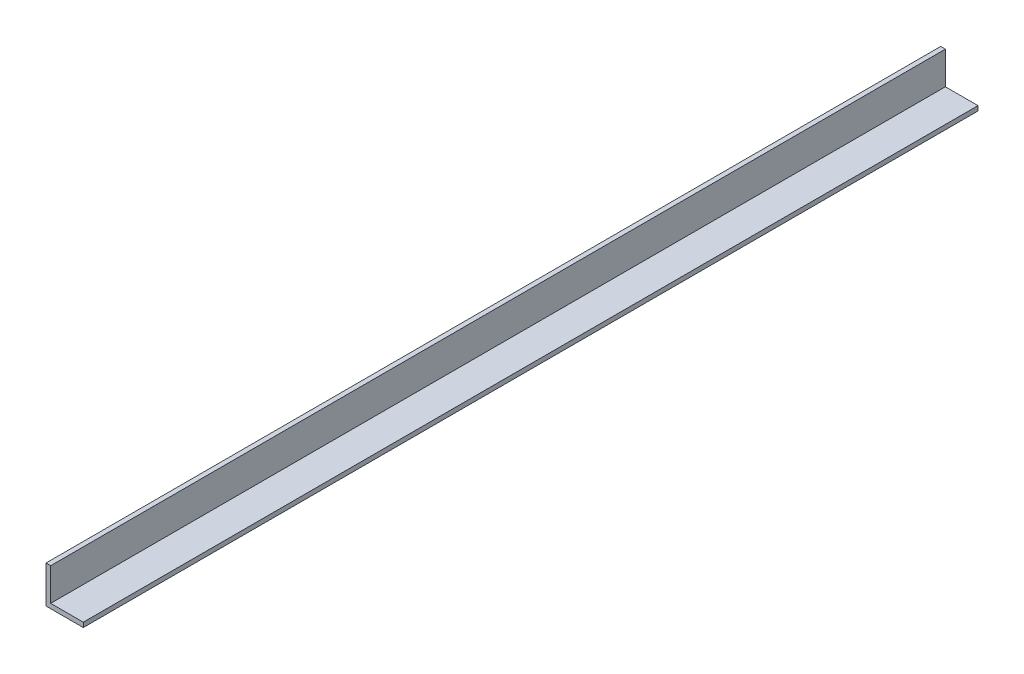
ISO-10303-21;
HEADER;
FILE_DESCRIPTION(('STEP AP214'),'2;1');
FILE_NAME('part.step','',(''),(''),'','','');
FILE_SCHEMA(('AUTOMOTIVE_DESIGN { 1 0 10303 214 1 1 1 1 }'));
ENDSEC;
DATA;
#1=APPLICATION_CONTEXT('core data for automotive mechanical design processes');
#2=APPLICATION_PROTOCOL_DEFINITION('international standard','automotive_design',2000,#1);
#3=PRODUCT_CONTEXT('',#1,'mechanical');
#4=PRODUCT('Part','Part','',(#3));
#5=PRODUCT_RELATED_PRODUCT_CATEGORY('part','',(#4));
#6=PRODUCT_DEFINITION_FORMATION('','',#4);
#7=PRODUCT_DEFINITION_CONTEXT('part definition',#1,'design');
#8=PRODUCT_DEFINITION('design','',#6,#7);
#9=PRODUCT_DEFINITION_SHAPE('','',#8);
#10=(LENGTH_UNIT() NAMED_UNIT(*) SI_UNIT(.MILLI.,.METRE.));
#11=(NAMED_UNIT(*) PLANE_ANGLE_UNIT() SI_UNIT($,.RADIAN.));
#12=(NAMED_UNIT(*) SI_UNIT($,.STERADIAN.) SOLID_ANGLE_UNIT());
#13=UNCERTAINTY_MEASURE_WITH_UNIT(LENGTH_MEASURE(1.E-05),#10,'distance_accuracy_value','');
#14=(GEOMETRIC_REPRESENTATION_CONTEXT(3) GLOBAL_UNCERTAINTY_ASSIGNED_CONTEXT((#13)) GLOBAL_UNIT_ASSIGNED_CONTEXT((#10,
#11,#12)) REPRESENTATION_CONTEXT('',''));
#15=CARTESIAN_POINT('',(0.,0.,0.));
#16=DIRECTION('',(0.,0.,1.));
#17=DIRECTION('',(1.,0.,0.));
#18=AXIS2_PLACEMENT_3D('',#15,#16,#17);
#19=CARTESIAN_POINT('',(3.175,25.4,304.8));
#20=DIRECTION('',(0.,-1.,0.));
#21=DIRECTION('',(0.,0.,-1.));
#22=AXIS2_PLACEMENT_3D('',#19,#20,#21);
#23=PLANE('',#22);
#24=DIRECTION('',(-1.,0.,0.));
#25=VECTOR('',#24,1.);
#26=CARTESIAN_POINT('',(3.175,25.4,-304.8));
#27=LINE('',#26,#25);
#28=CARTESIAN_POINT('',(3.175,25.4,-304.8));
#29=VERTEX_POINT('',#28);
#30=CARTESIAN_POINT('',(0.,25.4,-304.8));
#31=VERTEX_POINT('',#30);
#32=EDGE_CURVE('E127',#29,#31,#27,.T.);
#33=ORIENTED_EDGE('',*,*,#32,.T.);
#34=DIRECTION('',(0.,0.,-1.));
#35=VECTOR('',#34,1.);
#36=CARTESIAN_POINT('',(0.,25.4,304.8));
#37=LINE('',#36,#35);
#38=CARTESIAN_POINT('',(0.,25.4,304.8));
#39=VERTEX_POINT('',#38);
#40=EDGE_CURVE('E11',#39,#31,#37,.T.);
#41=ORIENTED_EDGE('',*,*,#40,.F.);
#42=DIRECTION('',(-1.,0.,0.));
#43=VECTOR('',#42,1.);
#44=CARTESIAN_POINT('',(3.175,25.4,304.8));
#45=LINE('',#44,#43);
#46=CARTESIAN_POINT('',(3.175,25.4,304.8));
#47=VERTEX_POINT('',#46);
#48=EDGE_CURVE('E137',#47,#39,#45,.T.);
#49=ORIENTED_EDGE('',*,*,#48,.F.);
#50=DIRECTION('',(0.,0.,-1.));
#51=VECTOR('',#50,1.);
#52=CARTESIAN_POINT('',(3.175,25.4,304.8));
#53=LINE('',#52,#51);
#54=EDGE_CURVE('E123',#47,#29,#53,.T.);
#55=ORIENTED_EDGE('',*,*,#54,.T.);
#56=EDGE_LOOP('',(#33,#41,#49,#55));
#57=FACE_BOUND('',#56,.T.);
#58=ADVANCED_FACE('F43',(#57),#23,.F.);
#59=CARTESIAN_POINT('',(0.,25.4,304.8));
#60=DIRECTION('',(1.,0.,0.));
#61=DIRECTION('',(0.,0.,-1.));
#62=AXIS2_PLACEMENT_3D('',#59,#60,#61);
#63=PLANE('',#62);
#64=DIRECTION('',(0.,-1.,0.));
#65=VECTOR('',#64,1.);
#66=CARTESIAN_POINT('',(0.,25.4,-304.8));
#67=LINE('',#66,#65);
#68=CARTESIAN_POINT('',(0.,0.,-304.8));
#69=VERTEX_POINT('',#68);
#70=EDGE_CURVE('E130',#31,#69,#67,.T.);
#71=ORIENTED_EDGE('',*,*,#70,.T.);
#72=DIRECTION('',(0.,0.,-1.));
#73=VECTOR('',#72,1.);
#74=CARTESIAN_POINT('',(0.,0.,304.8));
#75=LINE('',#74,#73);
#76=CARTESIAN_POINT('',(0.,0.,304.8));
#77=VERTEX_POINT('',#76);
#78=EDGE_CURVE('E51',#77,#69,#75,.T.);
#79=ORIENTED_EDGE('',*,*,#78,.F.);
#80=DIRECTION('',(0.,-1.,0.));
#81=VECTOR('',#80,1.);
#82=CARTESIAN_POINT('',(0.,25.4,304.8));
#83=LINE('',#82,#81);
#84=EDGE_CURVE('E96',#39,#77,#83,.T.);
#85=ORIENTED_EDGE('',*,*,#84,.F.);
#86=ORIENTED_EDGE('',*,*,#40,.T.);
#87=EDGE_LOOP('',(#71,#79,#85,#86));
#88=FACE_BOUND('',#87,.T.);
#89=ADVANCED_FACE('F161',(#88),#63,.F.);
#90=CARTESIAN_POINT('',(0.,0.,304.8));
#91=DIRECTION('',(0.,1.,0.));
#92=DIRECTION('',(0.,0.,1.));
#93=AXIS2_PLACEMENT_3D('',#90,#91,#92);
#94=PLANE('',#93);
#95=DIRECTION('',(1.,0.,0.));
#96=VECTOR('',#95,1.);
#97=CARTESIAN_POINT('',(0.,0.,-304.8));
#98=LINE('',#97,#96);
#99=CARTESIAN_POINT('',(25.4,0.,-304.8));
#100=VERTEX_POINT('',#99);
#101=EDGE_CURVE('E132',#69,#100,#98,.T.);
#102=ORIENTED_EDGE('',*,*,#101,.T.);
#103=DIRECTION('',(0.,0.,-1.));
#104=VECTOR('',#103,1.);
#105=CARTESIAN_POINT('',(25.4,0.,304.8));
#106=LINE('',#105,#104);
#107=CARTESIAN_POINT('',(25.4,0.,304.8));
#108=VERTEX_POINT('',#107);
#109=EDGE_CURVE('E118',#108,#100,#106,.T.);
#110=ORIENTED_EDGE('',*,*,#109,.F.);
#111=DIRECTION('',(1.,0.,0.));
#112=VECTOR('',#111,1.);
#113=CARTESIAN_POINT('',(0.,0.,304.8));
#114=LINE('',#113,#112);
#115=EDGE_CURVE('E109',#77,#108,#114,.T.);
#116=ORIENTED_EDGE('',*,*,#115,.F.);
#117=ORIENTED_EDGE('',*,*,#78,.T.);
#118=EDGE_LOOP('',(#102,#110,#116,#117));
#119=FACE_BOUND('',#118,.T.);
#120=ADVANCED_FACE('F143',(#119),#94,.F.);
#121=CARTESIAN_POINT('',(25.4,0.,304.8));
#122=DIRECTION('',(-1.,0.,0.));
#123=DIRECTION('',(0.,0.,1.));
#124=AXIS2_PLACEMENT_3D('',#121,#122,#123);
#125=PLANE('',#124);
#126=DIRECTION('',(0.,1.,0.));
#127=VECTOR('',#126,1.);
#128=CARTESIAN_POINT('',(25.4,0.,-304.8));
#129=LINE('',#128,#127);
#130=CARTESIAN_POINT('',(25.4,3.175,-304.8));
#131=VERTEX_POINT('',#130);
#132=EDGE_CURVE('E117',#100,#131,#129,.T.);
#133=ORIENTED_EDGE('',*,*,#132,.T.);
#134=DIRECTION('',(0.,0.,-1.));
#135=VECTOR('',#134,1.);
#136=CARTESIAN_POINT('',(25.4,3.175,304.8));
#137=LINE('',#136,#135);
#138=CARTESIAN_POINT('',(25.4,3.175,304.8));
#139=VERTEX_POINT('',#138);
#140=EDGE_CURVE('E114',#139,#131,#137,.T.);
#141=ORIENTED_EDGE('',*,*,#140,.F.);
#142=DIRECTION('',(0.,1.,0.));
#143=VECTOR('',#142,1.);
#144=CARTESIAN_POINT('',(25.4,0.,304.8));
#145=LINE('',#144,#143);
#146=EDGE_CURVE('E103',#108,#139,#145,.T.);
#147=ORIENTED_EDGE('',*,*,#146,.F.);
#148=ORIENTED_EDGE('',*,*,#109,.T.);
#149=EDGE_LOOP('',(#133,#141,#147,#148));
#150=FACE_BOUND('',#149,.T.);
#151=ADVANCED_FACE('F115',(#150),#125,.F.);
#152=CARTESIAN_POINT('',(25.4,3.175,304.8));
#153=DIRECTION('',(0.,-1.,0.));
#154=DIRECTION('',(0.,0.,-1.));
#155=AXIS2_PLACEMENT_3D('',#152,#153,#154);
#156=PLANE('',#155);
#157=DIRECTION('',(-1.,0.,0.));
#158=VECTOR('',#157,1.);
#159=CARTESIAN_POINT('',(25.4,3.175,-304.8));
#160=LINE('',#159,#158);
#161=CARTESIAN_POINT('',(3.175,3.175,-304.8));
#162=VERTEX_POINT('',#161);
#163=EDGE_CURVE('E82',#131,#162,#160,.T.);
#164=ORIENTED_EDGE('',*,*,#163,.T.);
#165=DIRECTION('',(0.,0.,-1.));
#166=VECTOR('',#165,1.);
#167=CARTESIAN_POINT('',(3.175,3.175,304.8));
#168=LINE('',#167,#166);
#169=CARTESIAN_POINT('',(3.175,3.175,304.8));
#170=VERTEX_POINT('',#169);
#171=EDGE_CURVE('E119',#170,#162,#168,.T.);
#172=ORIENTED_EDGE('',*,*,#171,.F.);
#173=DIRECTION('',(-1.,0.,0.));
#174=VECTOR('',#173,1.);
#175=CARTESIAN_POINT('',(25.4,3.175,304.8));
#176=LINE('',#175,#174);
#177=EDGE_CURVE('E107',#139,#170,#176,.T.);
#178=ORIENTED_EDGE('',*,*,#177,.F.);
#179=ORIENTED_EDGE('',*,*,#140,.T.);
#180=EDGE_LOOP('',(#164,#172,#178,#179));
#181=FACE_BOUND('',#180,.T.);
#182=ADVANCED_FACE('F121',(#181),#156,.F.);
#183=CARTESIAN_POINT('',(3.175,3.175,304.8));
#184=DIRECTION('',(-1.,0.,0.));
#185=DIRECTION('',(0.,0.,1.));
#186=AXIS2_PLACEMENT_3D('',#183,#184,#185);
#187=PLANE('',#186);
#188=DIRECTION('',(0.,1.,0.));
#189=VECTOR('',#188,1.);
#190=CARTESIAN_POINT('',(3.175,3.175,-304.8));
#191=LINE('',#190,#189);
#192=EDGE_CURVE('E88',#162,#29,#191,.T.);
#193=ORIENTED_EDGE('',*,*,#192,.T.);
#194=ORIENTED_EDGE('',*,*,#54,.F.);
#195=DIRECTION('',(0.,1.,0.));
#196=VECTOR('',#195,1.);
#197=CARTESIAN_POINT('',(3.175,3.175,304.8));
#198=LINE('',#197,#196);
#199=EDGE_CURVE('E59',#170,#47,#198,.T.);
#200=ORIENTED_EDGE('',*,*,#199,.F.);
#201=ORIENTED_EDGE('',*,*,#171,.T.);
#202=EDGE_LOOP('',(#193,#194,#200,#201));
#203=FACE_BOUND('',#202,.T.);
#204=ADVANCED_FACE('F150',(#203),#187,.F.);
#205=CARTESIAN_POINT('',(0.,0.,304.8));
#206=DIRECTION('',(0.,0.,1.));
#207=DIRECTION('',(1.,0.,0.));
#208=AXIS2_PLACEMENT_3D('',#205,#206,#207);
#209=PLANE('',#208);
#210=ORIENTED_EDGE('',*,*,#48,.T.);
#211=ORIENTED_EDGE('',*,*,#84,.T.);
#212=ORIENTED_EDGE('',*,*,#115,.T.);
#213=ORIENTED_EDGE('',*,*,#146,.T.);
#214=ORIENTED_EDGE('',*,*,#177,.T.);
#215=ORIENTED_EDGE('',*,*,#199,.T.);
#216=EDGE_LOOP('',(#210,#211,#212,#213,#214,#215));
#217=FACE_BOUND('',#216,.T.);
#218=ADVANCED_FACE('F105',(#217),#209,.T.);
#219=CARTESIAN_POINT('',(0.,0.,-304.8));
#220=DIRECTION('',(0.,0.,1.));
#221=DIRECTION('',(1.,0.,0.));
#222=AXIS2_PLACEMENT_3D('',#219,#220,#221);
#223=PLANE('',#222);
#224=ORIENTED_EDGE('',*,*,#32,.F.);
#225=ORIENTED_EDGE('',*,*,#192,.F.);
#226=ORIENTED_EDGE('',*,*,#163,.F.);
#227=ORIENTED_EDGE('',*,*,#132,.F.);
#228=ORIENTED_EDGE('',*,*,#101,.F.);
#229=ORIENTED_EDGE('',*,*,#70,.F.);
#230=EDGE_LOOP('',(#224,#225,#226,#227,#228,#229));
#231=FACE_BOUND('',#230,.T.);
#232=ADVANCED_FACE('F146',(#231),#223,.F.);
#233=CLOSED_SHELL('',(#58,#89,#120,#151,#182,#204,#218,#232));
#234=MANIFOLD_SOLID_BREP('B2',#233);
#235=ADVANCED_BREP_SHAPE_REPRESENTATION('',(#18,#234),#14);
#236=SHAPE_DEFINITION_REPRESENTATION(#9,#235);
ENDSEC;
END-ISO-10303-21;
